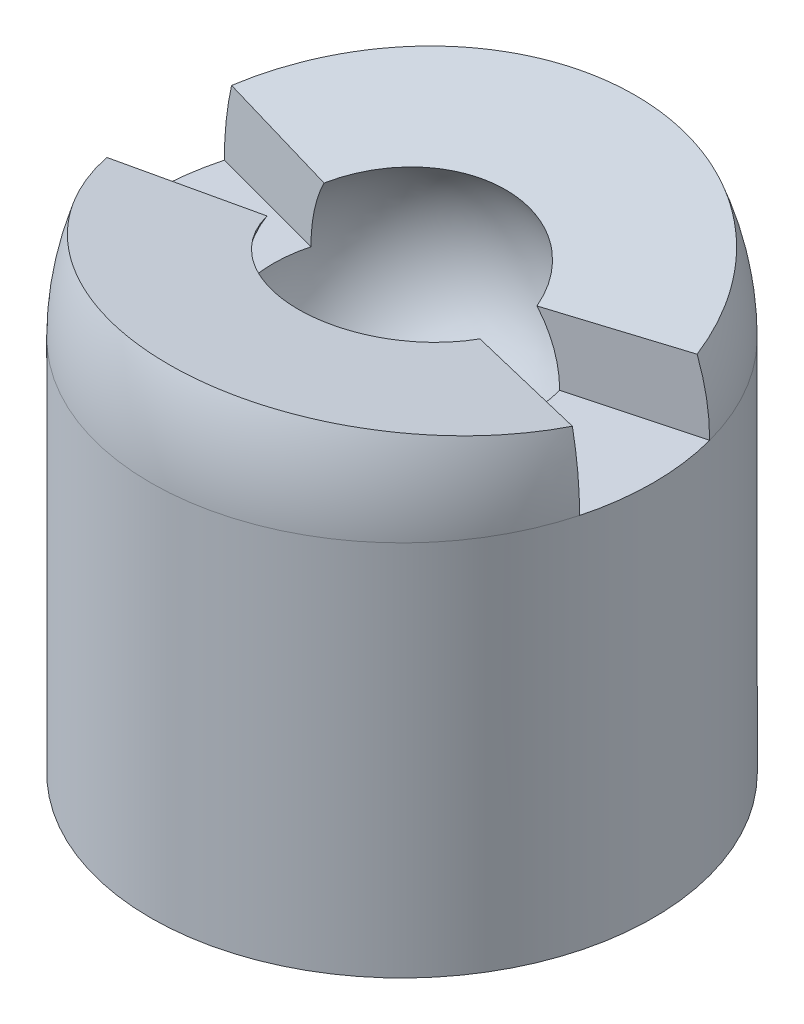
ISO-10303-21;
HEADER;
FILE_DESCRIPTION(('STEP AP214'),'2;1');
FILE_NAME('part.step','',(''),(''),'','','');
FILE_SCHEMA(('AUTOMOTIVE_DESIGN { 1 0 10303 214 1 1 1 1 }'));
ENDSEC;
DATA;
#1=APPLICATION_CONTEXT('core data for automotive mechanical design processes');
#2=APPLICATION_PROTOCOL_DEFINITION('international standard','automotive_design',2000,#1);
#3=PRODUCT_CONTEXT('',#1,'mechanical');
#4=PRODUCT('Part','Part','',(#3));
#5=PRODUCT_RELATED_PRODUCT_CATEGORY('part','',(#4));
#6=PRODUCT_DEFINITION_FORMATION('','',#4);
#7=PRODUCT_DEFINITION_CONTEXT('part definition',#1,'design');
#8=PRODUCT_DEFINITION('design','',#6,#7);
#9=PRODUCT_DEFINITION_SHAPE('','',#8);
#10=(LENGTH_UNIT() NAMED_UNIT(*) SI_UNIT(.MILLI.,.METRE.));
#11=(NAMED_UNIT(*) PLANE_ANGLE_UNIT() SI_UNIT($,.RADIAN.));
#12=(NAMED_UNIT(*) SI_UNIT($,.STERADIAN.) SOLID_ANGLE_UNIT());
#13=UNCERTAINTY_MEASURE_WITH_UNIT(LENGTH_MEASURE(1.E-05),#10,'distance_accuracy_value','');
#14=(GEOMETRIC_REPRESENTATION_CONTEXT(3) GLOBAL_UNCERTAINTY_ASSIGNED_CONTEXT((#13)) GLOBAL_UNIT_ASSIGNED_CONTEXT((#10,
#11,#12)) REPRESENTATION_CONTEXT('',''));
#15=CARTESIAN_POINT('',(0.,0.,0.));
#16=DIRECTION('',(0.,0.,1.));
#17=DIRECTION('',(1.,0.,0.));
#18=AXIS2_PLACEMENT_3D('',#15,#16,#17);
#19=CARTESIAN_POINT('',(0.,6.,0.));
#20=DIRECTION('',(0.,1.,0.));
#21=DIRECTION('',(0.,0.,1.));
#22=AXIS2_PLACEMENT_3D('',#19,#20,#21);
#23=SPHERICAL_SURFACE('',#22,4.);
#24=CARTESIAN_POINT('',(0.,6.98296291314453,0.129409522551265));
#25=DIRECTION('',(0.,-0.99144486137381,-0.130526192220056));
#26=DIRECTION('',(0.,0.130526192220056,-0.99144486137381));
#27=AXIS2_PLACEMENT_3D('',#24,#25,#26);
#28=CIRCLE('',#27,3.87518220047206);
#29=CARTESIAN_POINT('',(3.70611435083783,7.13073755846056,-0.993050347364394));
#30=VERTEX_POINT('',#29);
#31=CARTESIAN_POINT('',(-3.70611435083784,7.13073755846055,-0.993050347364368));
#32=VERTEX_POINT('',#31);
#33=EDGE_CURVE('E118',#30,#32,#28,.F.);
#34=ORIENTED_EDGE('',*,*,#33,.F.);
#35=CARTESIAN_POINT('',(0.,6.,0.));
#36=DIRECTION('',(0.258819045102522,0.,0.965925826289068));
#37=DIRECTION('',(0.965925826289068,0.,-0.258819045102522));
#38=AXIS2_PLACEMENT_3D('',#35,#36,#37);
#39=CIRCLE('',#38,4.);
#40=CARTESIAN_POINT('',(3.86370330515627,6.,-1.03527618041009));
#41=VERTEX_POINT('',#40);
#42=EDGE_CURVE('E109',#30,#41,#39,.F.);
#43=ORIENTED_EDGE('',*,*,#42,.T.);
#44=CARTESIAN_POINT('',(0.,6.,0.));
#45=DIRECTION('',(0.,-1.,0.));
#46=DIRECTION('',(0.,0.,-1.));
#47=AXIS2_PLACEMENT_3D('',#44,#45,#46);
#48=CIRCLE('',#47,4.);
#49=CARTESIAN_POINT('',(-3.86370330515628,6.,-1.03527618041006));
#50=VERTEX_POINT('',#49);
#51=EDGE_CURVE('E103',#50,#41,#48,.T.);
#52=ORIENTED_EDGE('',*,*,#51,.F.);
#53=CARTESIAN_POINT('',(0.,6.,0.));
#54=DIRECTION('',(-0.258819045102514,0.,0.96592582628907));
#55=DIRECTION('',(0.96592582628907,0.,0.258819045102514));
#56=AXIS2_PLACEMENT_3D('',#53,#54,#55);
#57=CIRCLE('',#56,4.);
#58=EDGE_CURVE('E165',#50,#32,#57,.F.);
#59=ORIENTED_EDGE('',*,*,#58,.T.);
#60=EDGE_LOOP('',(#34,#43,#52,#59));
#61=FACE_BOUND('',#60,.T.);
#62=ADVANCED_FACE('F33',(#61),#23,.T.);
#63=CARTESIAN_POINT('',(3.86370330515628,6.,1.03527618041006));
#64=VERTEX_POINT('',#63);
#65=CARTESIAN_POINT('',(-3.86370330515627,6.,1.03527618041009));
#66=VERTEX_POINT('',#65);
#67=EDGE_CURVE('E104',#64,#66,#48,.T.);
#68=ORIENTED_EDGE('',*,*,#67,.F.);
#69=CARTESIAN_POINT('',(0.,6.,0.));
#70=DIRECTION('',(0.258819045102514,0.,-0.96592582628907));
#71=DIRECTION('',(-0.96592582628907,0.,-0.258819045102514));
#72=AXIS2_PLACEMENT_3D('',#69,#70,#71);
#73=CIRCLE('',#72,4.);
#74=CARTESIAN_POINT('',(3.70611435083784,7.13073755846055,0.993050347364364));
#75=VERTEX_POINT('',#74);
#76=EDGE_CURVE('E153',#64,#75,#73,.F.);
#77=ORIENTED_EDGE('',*,*,#76,.T.);
#78=CARTESIAN_POINT('',(0.,6.98296291314453,-0.129409522551264));
#79=DIRECTION('',(0.,-0.99144486137381,0.130526192220055));
#80=DIRECTION('',(0.,-0.130526192220055,-0.99144486137381));
#81=AXIS2_PLACEMENT_3D('',#78,#79,#80);
#82=CIRCLE('',#81,3.87518220047206);
#83=CARTESIAN_POINT('',(-3.70611435083783,7.13073755846056,0.993050347364393));
#84=VERTEX_POINT('',#83);
#85=EDGE_CURVE('E152',#84,#75,#82,.F.);
#86=ORIENTED_EDGE('',*,*,#85,.F.);
#87=CARTESIAN_POINT('',(0.,6.,0.));
#88=DIRECTION('',(-0.258819045102521,0.,-0.965925826289068));
#89=DIRECTION('',(-0.965925826289068,0.,0.258819045102521));
#90=AXIS2_PLACEMENT_3D('',#87,#88,#89);
#91=CIRCLE('',#90,4.);
#92=EDGE_CURVE('E164',#84,#66,#91,.F.);
#93=ORIENTED_EDGE('',*,*,#92,.T.);
#94=EDGE_LOOP('',(#68,#77,#86,#93));
#95=FACE_BOUND('',#94,.T.);
#96=ADVANCED_FACE('F203',(#95),#23,.T.);
#97=CARTESIAN_POINT('',(-7.5,10.1625036181934,24.0215998644003));
#98=DIRECTION('',(0.,-0.99144486137381,0.130526192220055));
#99=DIRECTION('',(0.,-0.130526192220055,-0.99144486137381));
#100=AXIS2_PLACEMENT_3D('',#97,#98,#99);
#101=PLANE('',#100);
#102=DIRECTION('',(0.965365570346444,0.034054410021224,0.258668924975133));
#103=VECTOR('',#102,1.);
#104=CARTESIAN_POINT('',(-0.887077482398166,6.9687072946932,-0.237691695032419));
#105=LINE('',#104,#103);
#106=CARTESIAN_POINT('',(1.69501068347547,7.0597935026673,0.454176743799366));
#107=VERTEX_POINT('',#106);
#108=EDGE_CURVE('E143',#107,#75,#105,.T.);
#109=ORIENTED_EDGE('',*,*,#108,.F.);
#110=CARTESIAN_POINT('',(0.,6.98296291314453,-0.129409522551264));
#111=DIRECTION('',(0.,-0.99144486137381,0.130526192220055));
#112=DIRECTION('',(0.,-0.130526192220055,-0.99144486137381));
#113=AXIS2_PLACEMENT_3D('',#110,#111,#112);
#114=CIRCLE('',#113,1.79430685415162);
#115=CARTESIAN_POINT('',(-1.69501068347547,7.0597935026673,0.454176743799378));
#116=VERTEX_POINT('',#115);
#117=EDGE_CURVE('E130',#116,#107,#114,.F.);
#118=ORIENTED_EDGE('',*,*,#117,.F.);
#119=DIRECTION('',(0.965365570346442,-0.0340544100212249,-0.25866892497514));
#120=VECTOR('',#119,1.);
#121=CARTESIAN_POINT('',(-13.0918827837567,7.46183161898748,3.50795941931053));
#122=LINE('',#121,#120);
#123=EDGE_CURVE('E163',#84,#116,#122,.T.);
#124=ORIENTED_EDGE('',*,*,#123,.F.);
#125=ORIENTED_EDGE('',*,*,#85,.T.);
#126=EDGE_LOOP('',(#109,#118,#124,#125));
#127=FACE_BOUND('',#126,.T.);
#128=ADVANCED_FACE('F149',(#127),#101,.F.);
#129=CARTESIAN_POINT('',(-7.5,7.,0.));
#130=DIRECTION('',(0.,-0.99144486137381,-0.130526192220056));
#131=DIRECTION('',(0.,0.130526192220056,-0.99144486137381));
#132=AXIS2_PLACEMENT_3D('',#129,#130,#131);
#133=PLANE('',#132);
#134=DIRECTION('',(-0.965365570346442,-0.0340544100212251,0.25866892497514));
#135=VECTOR('',#134,1.);
#136=CARTESIAN_POINT('',(-6.98948013307734,6.75343783785286,1.87282555717146));
#137=LINE('',#136,#135);
#138=CARTESIAN_POINT('',(1.69501068347547,7.0597935026673,-0.454176743799377));
#139=VERTEX_POINT('',#138);
#140=EDGE_CURVE('E119',#30,#139,#137,.T.);
#141=ORIENTED_EDGE('',*,*,#140,.F.);
#142=ORIENTED_EDGE('',*,*,#33,.T.);
#143=DIRECTION('',(-0.965365570346444,0.0340544100212241,-0.258668924975133));
#144=VECTOR('',#143,1.);
#145=CARTESIAN_POINT('',(-6.98948013307736,7.24656216214713,-1.87282555717141));
#146=LINE('',#145,#144);
#147=CARTESIAN_POINT('',(-1.69501068347547,7.0597935026673,-0.454176743799366));
#148=VERTEX_POINT('',#147);
#149=EDGE_CURVE('E168',#148,#32,#146,.T.);
#150=ORIENTED_EDGE('',*,*,#149,.F.);
#151=CARTESIAN_POINT('',(0.,6.98296291314453,0.129409522551265));
#152=DIRECTION('',(0.,-0.99144486137381,-0.130526192220056));
#153=DIRECTION('',(0.,0.130526192220056,-0.99144486137381));
#154=AXIS2_PLACEMENT_3D('',#151,#152,#153);
#155=CIRCLE('',#154,1.79430685415162);
#156=EDGE_CURVE('E124',#139,#148,#155,.F.);
#157=ORIENTED_EDGE('',*,*,#156,.F.);
#158=EDGE_LOOP('',(#141,#142,#150,#157));
#159=FACE_BOUND('',#158,.T.);
#160=ADVANCED_FACE('F191',(#159),#133,.F.);
#161=CARTESIAN_POINT('',(0.,6.,0.));
#162=DIRECTION('',(0.,0.,1.));
#163=DIRECTION('',(0.,1.,0.));
#164=AXIS2_PLACEMENT_3D('',#161,#162,#163);
#165=SPHERICAL_SURFACE('',#164,2.05);
#166=CARTESIAN_POINT('',(0.,6.,0.));
#167=DIRECTION('',(0.258819045102522,0.,0.965925826289068));
#168=DIRECTION('',(0.965925826289068,0.,-0.258819045102522));
#169=AXIS2_PLACEMENT_3D('',#166,#167,#168);
#170=CIRCLE('',#169,2.05);
#171=CARTESIAN_POINT('',(1.98014794389259,6.,-0.530579042460169));
#172=VERTEX_POINT('',#171);
#173=EDGE_CURVE('E11',#139,#172,#170,.F.);
#174=ORIENTED_EDGE('',*,*,#173,.F.);
#175=ORIENTED_EDGE('',*,*,#156,.T.);
#176=CARTESIAN_POINT('',(0.,6.,0.));
#177=DIRECTION('',(-0.258819045102514,0.,0.96592582628907));
#178=DIRECTION('',(0.96592582628907,0.,0.258819045102514));
#179=AXIS2_PLACEMENT_3D('',#176,#177,#178);
#180=CIRCLE('',#179,2.05);
#181=CARTESIAN_POINT('',(-1.98014794389259,6.,-0.530579042460154));
#182=VERTEX_POINT('',#181);
#183=EDGE_CURVE('E135',#182,#148,#180,.F.);
#184=ORIENTED_EDGE('',*,*,#183,.F.);
#185=CARTESIAN_POINT('',(0.,6.,0.));
#186=DIRECTION('',(0.,1.,0.));
#187=DIRECTION('',(0.,0.,1.));
#188=AXIS2_PLACEMENT_3D('',#185,#186,#187);
#189=CIRCLE('',#188,2.05);
#190=CARTESIAN_POINT('',(-1.98014794389259,6.,0.53057904246017));
#191=VERTEX_POINT('',#190);
#192=EDGE_CURVE('E133',#191,#182,#189,.F.);
#193=ORIENTED_EDGE('',*,*,#192,.F.);
#194=CARTESIAN_POINT('',(0.,6.,0.));
#195=DIRECTION('',(-0.258819045102521,0.,-0.965925826289068));
#196=DIRECTION('',(-0.965925826289068,0.,0.258819045102521));
#197=AXIS2_PLACEMENT_3D('',#194,#195,#196);
#198=CIRCLE('',#197,2.05);
#199=EDGE_CURVE('E138',#116,#191,#198,.F.);
#200=ORIENTED_EDGE('',*,*,#199,.F.);
#201=ORIENTED_EDGE('',*,*,#117,.T.);
#202=CARTESIAN_POINT('',(0.,6.,0.));
#203=DIRECTION('',(0.258819045102514,0.,-0.96592582628907));
#204=DIRECTION('',(-0.96592582628907,0.,-0.258819045102514));
#205=AXIS2_PLACEMENT_3D('',#202,#203,#204);
#206=CIRCLE('',#205,2.05);
#207=CARTESIAN_POINT('',(1.98014794389259,6.,0.530579042460155));
#208=VERTEX_POINT('',#207);
#209=EDGE_CURVE('E40',#208,#107,#206,.F.);
#210=ORIENTED_EDGE('',*,*,#209,.F.);
#211=CARTESIAN_POINT('',(0.,6.,0.));
#212=DIRECTION('',(0.,-1.,0.));
#213=DIRECTION('',(0.,0.,-1.));
#214=AXIS2_PLACEMENT_3D('',#211,#212,#213);
#215=CIRCLE('',#214,2.05);
#216=EDGE_CURVE('E154',#208,#172,#215,.F.);
#217=ORIENTED_EDGE('',*,*,#216,.T.);
#218=EDGE_LOOP('',(#174,#175,#184,#193,#200,#201,#210,#217));
#219=FACE_BOUND('',#218,.T.);
#220=ADVANCED_FACE('F157',(#219),#165,.F.);
#221=CARTESIAN_POINT('',(0.,10.,0.));
#222=DIRECTION('',(0.,-1.,0.));
#223=DIRECTION('',(0.,0.,-1.));
#224=AXIS2_PLACEMENT_3D('',#221,#222,#223);
#225=CYLINDRICAL_SURFACE('',#224,4.);
#226=EDGE_CURVE('E123',#66,#50,#48,.T.);
#227=ORIENTED_EDGE('',*,*,#226,.T.);
#228=ORIENTED_EDGE('',*,*,#51,.T.);
#229=EDGE_CURVE('E96',#41,#64,#48,.T.);
#230=ORIENTED_EDGE('',*,*,#229,.T.);
#231=ORIENTED_EDGE('',*,*,#67,.T.);
#232=EDGE_LOOP('',(#227,#228,#230,#231));
#233=FACE_BOUND('',#232,.T.);
#234=CARTESIAN_POINT('',(0.,0.,0.));
#235=DIRECTION('',(0.,1.,0.));
#236=DIRECTION('',(0.,0.,1.));
#237=AXIS2_PLACEMENT_3D('',#234,#235,#236);
#238=CIRCLE('',#237,4.);
#239=CARTESIAN_POINT('',(0.,0.,4.));
#240=VERTEX_POINT('',#239);
#241=EDGE_CURVE('E127',#240,#240,#238,.T.);
#242=ORIENTED_EDGE('',*,*,#241,.T.);
#243=EDGE_LOOP('',(#242));
#244=FACE_BOUND('',#243,.T.);
#245=ADVANCED_FACE('F121',(#233,#244),#225,.T.);
#246=CARTESIAN_POINT('',(0.,0.,0.));
#247=DIRECTION('',(0.,1.,0.));
#248=DIRECTION('',(0.,0.,1.));
#249=AXIS2_PLACEMENT_3D('',#246,#247,#248);
#250=PLANE('',#249);
#251=ORIENTED_EDGE('',*,*,#241,.F.);
#252=EDGE_LOOP('',(#251));
#253=FACE_BOUND('',#252,.T.);
#254=ADVANCED_FACE('F218',(#253),#250,.F.);
#255=CARTESIAN_POINT('',(0.,6.,0.));
#256=DIRECTION('',(0.,1.,0.));
#257=DIRECTION('',(0.,0.,1.));
#258=AXIS2_PLACEMENT_3D('',#255,#256,#257);
#259=PLANE('',#258);
#260=DIRECTION('',(0.965925826289068,0.,-0.258819045102522));
#261=VECTOR('',#260,1.);
#262=CARTESIAN_POINT('',(-6.89078369561851,6.,1.84637992645853));
#263=LINE('',#262,#261);
#264=EDGE_CURVE('E55',#66,#191,#263,.T.);
#265=ORIENTED_EDGE('',*,*,#264,.T.);
#266=ORIENTED_EDGE('',*,*,#192,.T.);
#267=DIRECTION('',(-0.96592582628907,0.,-0.258819045102514));
#268=VECTOR('',#267,1.);
#269=CARTESIAN_POINT('',(-0.557440617096167,6.,-0.149365763179221));
#270=LINE('',#269,#268);
#271=EDGE_CURVE('E179',#182,#50,#270,.T.);
#272=ORIENTED_EDGE('',*,*,#271,.T.);
#273=ORIENTED_EDGE('',*,*,#226,.F.);
#274=EDGE_LOOP('',(#265,#266,#272,#273));
#275=FACE_BOUND('',#274,.T.);
#276=ADVANCED_FACE('F177',(#275),#259,.T.);
#277=CARTESIAN_POINT('',(-6.89078369561851,21.,1.84637992645853));
#278=DIRECTION('',(-0.258819045102521,0.,-0.965925826289068));
#279=DIRECTION('',(-0.965925826289068,0.,0.258819045102521));
#280=AXIS2_PLACEMENT_3D('',#277,#278,#279);
#281=PLANE('',#280);
#282=ORIENTED_EDGE('',*,*,#123,.T.);
#283=ORIENTED_EDGE('',*,*,#199,.T.);
#284=ORIENTED_EDGE('',*,*,#264,.F.);
#285=ORIENTED_EDGE('',*,*,#92,.F.);
#286=EDGE_LOOP('',(#282,#283,#284,#285));
#287=FACE_BOUND('',#286,.T.);
#288=ADVANCED_FACE('F161',(#287),#281,.T.);
#289=CARTESIAN_POINT('',(-0.557440617096167,21.,-0.149365763179221));
#290=DIRECTION('',(-0.258819045102514,0.,0.96592582628907));
#291=DIRECTION('',(0.96592582628907,0.,0.258819045102514));
#292=AXIS2_PLACEMENT_3D('',#289,#290,#291);
#293=PLANE('',#292);
#294=ORIENTED_EDGE('',*,*,#271,.F.);
#295=ORIENTED_EDGE('',*,*,#183,.T.);
#296=ORIENTED_EDGE('',*,*,#149,.T.);
#297=ORIENTED_EDGE('',*,*,#58,.F.);
#298=EDGE_LOOP('',(#294,#295,#296,#297));
#299=FACE_BOUND('',#298,.T.);
#300=ADVANCED_FACE('F192',(#299),#293,.T.);
#301=CARTESIAN_POINT('',(0.,6.,0.));
#302=DIRECTION('',(0.,-1.,0.));
#303=DIRECTION('',(0.,0.,-1.));
#304=AXIS2_PLACEMENT_3D('',#301,#302,#303);
#305=PLANE('',#304);
#306=DIRECTION('',(0.96592582628907,0.,0.258819045102514));
#307=VECTOR('',#306,1.);
#308=CARTESIAN_POINT('',(7.86128850349755,6.,2.10642590598018));
#309=LINE('',#308,#307);
#310=EDGE_CURVE('E47',#208,#64,#309,.T.);
#311=ORIENTED_EDGE('',*,*,#310,.T.);
#312=ORIENTED_EDGE('',*,*,#229,.F.);
#313=DIRECTION('',(-0.965925826289068,0.,0.258819045102522));
#314=VECTOR('',#313,1.);
#315=CARTESIAN_POINT('',(0.614333785463747,6.,-0.164610241698166));
#316=LINE('',#315,#314);
#317=EDGE_CURVE('E99',#41,#172,#316,.T.);
#318=ORIENTED_EDGE('',*,*,#317,.T.);
#319=ORIENTED_EDGE('',*,*,#216,.F.);
#320=EDGE_LOOP('',(#311,#312,#318,#319));
#321=FACE_BOUND('',#320,.T.);
#322=ADVANCED_FACE('F98',(#321),#305,.F.);
#323=CARTESIAN_POINT('',(0.614333785463747,21.,-0.164610241698166));
#324=DIRECTION('',(0.258819045102522,0.,0.965925826289068));
#325=DIRECTION('',(0.965925826289068,0.,-0.258819045102522));
#326=AXIS2_PLACEMENT_3D('',#323,#324,#325);
#327=PLANE('',#326);
#328=ORIENTED_EDGE('',*,*,#140,.T.);
#329=ORIENTED_EDGE('',*,*,#173,.T.);
#330=ORIENTED_EDGE('',*,*,#317,.F.);
#331=ORIENTED_EDGE('',*,*,#42,.F.);
#332=EDGE_LOOP('',(#328,#329,#330,#331));
#333=FACE_BOUND('',#332,.T.);
#334=ADVANCED_FACE('F108',(#333),#327,.T.);
#335=CARTESIAN_POINT('',(7.86128850349755,21.,2.10642590598018));
#336=DIRECTION('',(0.258819045102514,0.,-0.96592582628907));
#337=DIRECTION('',(-0.96592582628907,0.,-0.258819045102514));
#338=AXIS2_PLACEMENT_3D('',#335,#336,#337);
#339=PLANE('',#338);
#340=ORIENTED_EDGE('',*,*,#310,.F.);
#341=ORIENTED_EDGE('',*,*,#209,.T.);
#342=ORIENTED_EDGE('',*,*,#108,.T.);
#343=ORIENTED_EDGE('',*,*,#76,.F.);
#344=EDGE_LOOP('',(#340,#341,#342,#343));
#345=FACE_BOUND('',#344,.T.);
#346=ADVANCED_FACE('F142',(#345),#339,.T.);
#347=CLOSED_SHELL('',(#62,#96,#128,#160,#220,#245,#254,#276,#288,#300,#322,#334,#346));
#348=MANIFOLD_SOLID_BREP('B2',#347);
#349=ADVANCED_BREP_SHAPE_REPRESENTATION('',(#18,#348),#14);
#350=SHAPE_DEFINITION_REPRESENTATION(#9,#349);
ENDSEC;
END-ISO-10303-21;
